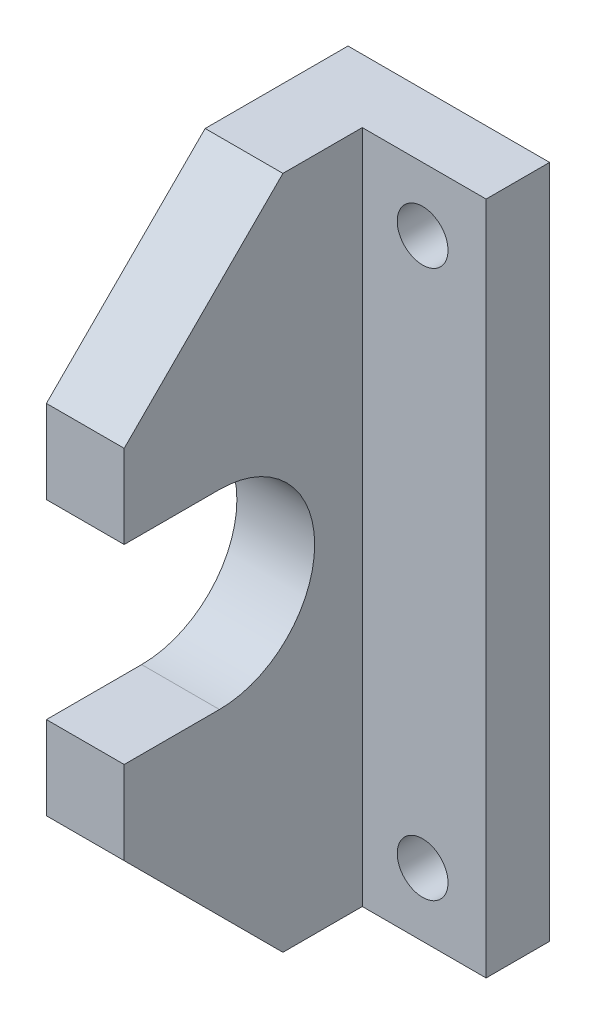
ISO-10303-21;
HEADER;
FILE_DESCRIPTION(('STEP AP214'),'2;1');
FILE_NAME('part.step','',(''),(''),'','','');
FILE_SCHEMA(('AUTOMOTIVE_DESIGN { 1 0 10303 214 1 1 1 1 }'));
ENDSEC;
DATA;
#1=APPLICATION_CONTEXT('core data for automotive mechanical design processes');
#2=APPLICATION_PROTOCOL_DEFINITION('international standard','automotive_design',2000,#1);
#3=PRODUCT_CONTEXT('',#1,'mechanical');
#4=PRODUCT('Part','Part','',(#3));
#5=PRODUCT_RELATED_PRODUCT_CATEGORY('part','',(#4));
#6=PRODUCT_DEFINITION_FORMATION('','',#4);
#7=PRODUCT_DEFINITION_CONTEXT('part definition',#1,'design');
#8=PRODUCT_DEFINITION('design','',#6,#7);
#9=PRODUCT_DEFINITION_SHAPE('','',#8);
#10=(LENGTH_UNIT() NAMED_UNIT(*) SI_UNIT(.MILLI.,.METRE.));
#11=(NAMED_UNIT(*) PLANE_ANGLE_UNIT() SI_UNIT($,.RADIAN.));
#12=(NAMED_UNIT(*) SI_UNIT($,.STERADIAN.) SOLID_ANGLE_UNIT());
#13=UNCERTAINTY_MEASURE_WITH_UNIT(LENGTH_MEASURE(1.E-05),#10,'distance_accuracy_value','');
#14=(GEOMETRIC_REPRESENTATION_CONTEXT(3) GLOBAL_UNCERTAINTY_ASSIGNED_CONTEXT((#13)) GLOBAL_UNIT_ASSIGNED_CONTEXT((#10,
#11,#12)) REPRESENTATION_CONTEXT('',''));
#15=CARTESIAN_POINT('',(0.,0.,0.));
#16=DIRECTION('',(0.,0.,1.));
#17=DIRECTION('',(1.,0.,0.));
#18=AXIS2_PLACEMENT_3D('',#15,#16,#17);
#19=CARTESIAN_POINT('',(0.,0.,19.));
#20=DIRECTION('',(0.,0.,1.));
#21=DIRECTION('',(1.,0.,0.));
#22=AXIS2_PLACEMENT_3D('',#19,#20,#21);
#23=PLANE('',#22);
#24=DIRECTION('',(0.,-1.,0.));
#25=VECTOR('',#24,1.);
#26=CARTESIAN_POINT('',(25.9154898415816,42.4999999977286,19.));
#27=LINE('',#26,#25);
#28=CARTESIAN_POINT('',(25.9154898415816,15.2500004309608,19.));
#29=VERTEX_POINT('',#28);
#30=CARTESIAN_POINT('',(25.9154898415816,9.99999999772865,19.));
#31=VERTEX_POINT('',#30);
#32=EDGE_CURVE('E171',#29,#31,#27,.T.);
#33=ORIENTED_EDGE('',*,*,#32,.T.);
#34=DIRECTION('',(1.,0.,0.));
#35=VECTOR('',#34,1.);
#36=CARTESIAN_POINT('',(30.8154898415816,9.99999999772864,19.));
#37=LINE('',#36,#35);
#38=CARTESIAN_POINT('',(30.8154898415816,9.99999999772866,19.));
#39=VERTEX_POINT('',#38);
#40=EDGE_CURVE('E46',#31,#39,#37,.T.);
#41=ORIENTED_EDGE('',*,*,#40,.T.);
#42=DIRECTION('',(0.,1.,0.));
#43=VECTOR('',#42,1.);
#44=CARTESIAN_POINT('',(30.8154898415816,42.4999999977286,19.));
#45=LINE('',#44,#43);
#46=CARTESIAN_POINT('',(30.8154898415816,15.2500004309608,19.));
#47=VERTEX_POINT('',#46);
#48=EDGE_CURVE('E172',#39,#47,#45,.T.);
#49=ORIENTED_EDGE('',*,*,#48,.T.);
#50=DIRECTION('',(1.,0.,0.));
#51=VECTOR('',#50,1.);
#52=CARTESIAN_POINT('',(25.9154898415816,15.2500004309608,19.));
#53=LINE('',#52,#51);
#54=EDGE_CURVE('E163',#29,#47,#53,.T.);
#55=ORIENTED_EDGE('',*,*,#54,.F.);
#56=EDGE_LOOP('',(#33,#41,#49,#55));
#57=FACE_BOUND('',#56,.T.);
#58=ADVANCED_FACE('F38',(#57),#23,.T.);
#59=CARTESIAN_POINT('',(0.,0.,4.));
#60=DIRECTION('',(0.,0.,-1.));
#61=DIRECTION('',(-1.,0.,0.));
#62=AXIS2_PLACEMENT_3D('',#59,#60,#61);
#63=PLANE('',#62);
#64=CARTESIAN_POINT('',(34.6154898415816,38.4999999977286,4.));
#65=DIRECTION('',(0.,0.,1.));
#66=DIRECTION('',(1.,0.,0.));
#67=AXIS2_PLACEMENT_3D('',#64,#65,#66);
#68=CIRCLE('',#67,1.6);
#69=CARTESIAN_POINT('',(36.2154898415816,38.4999999977286,4.));
#70=VERTEX_POINT('',#69);
#71=EDGE_CURVE('E177',#70,#70,#68,.T.);
#72=ORIENTED_EDGE('',*,*,#71,.F.);
#73=EDGE_LOOP('',(#72));
#74=FACE_BOUND('',#73,.T.);
#75=CARTESIAN_POINT('',(34.6154898415816,3.99999999772863,4.));
#76=DIRECTION('',(0.,0.,1.));
#77=DIRECTION('',(1.,0.,0.));
#78=AXIS2_PLACEMENT_3D('',#75,#76,#77);
#79=CIRCLE('',#78,1.6);
#80=CARTESIAN_POINT('',(36.2154898415816,3.99999999772863,4.));
#81=VERTEX_POINT('',#80);
#82=EDGE_CURVE('E243',#81,#81,#79,.T.);
#83=ORIENTED_EDGE('',*,*,#82,.F.);
#84=EDGE_LOOP('',(#83));
#85=FACE_BOUND('',#84,.T.);
#86=DIRECTION('',(0.,1.,0.));
#87=VECTOR('',#86,1.);
#88=CARTESIAN_POINT('',(30.8154898415816,42.4999999977286,4.));
#89=LINE('',#88,#87);
#90=CARTESIAN_POINT('',(30.8154898415816,-2.2713671249749E-09,4.));
#91=VERTEX_POINT('',#90);
#92=CARTESIAN_POINT('',(30.8154898415816,42.4999999977286,4.));
#93=VERTEX_POINT('',#92);
#94=EDGE_CURVE('E162',#91,#93,#89,.T.);
#95=ORIENTED_EDGE('',*,*,#94,.F.);
#96=DIRECTION('',(1.,0.,0.));
#97=VECTOR('',#96,1.);
#98=CARTESIAN_POINT('',(38.6154898415816,-2.2713671249749E-09,4.));
#99=LINE('',#98,#97);
#100=CARTESIAN_POINT('',(38.6154898415816,-2.2713671249749E-09,4.));
#101=VERTEX_POINT('',#100);
#102=EDGE_CURVE('E183',#91,#101,#99,.T.);
#103=ORIENTED_EDGE('',*,*,#102,.T.);
#104=DIRECTION('',(0.,1.,0.));
#105=VECTOR('',#104,1.);
#106=CARTESIAN_POINT('',(38.6154898415816,42.4999999977286,4.));
#107=LINE('',#106,#105);
#108=CARTESIAN_POINT('',(38.6154898415816,42.4999999977286,4.));
#109=VERTEX_POINT('',#108);
#110=EDGE_CURVE('E234',#101,#109,#107,.T.);
#111=ORIENTED_EDGE('',*,*,#110,.T.);
#112=DIRECTION('',(-1.,0.,0.));
#113=VECTOR('',#112,1.);
#114=CARTESIAN_POINT('',(38.6154898415816,42.4999999977286,4.));
#115=LINE('',#114,#113);
#116=EDGE_CURVE('E231',#109,#93,#115,.T.);
#117=ORIENTED_EDGE('',*,*,#116,.T.);
#118=EDGE_LOOP('',(#95,#103,#111,#117));
#119=FACE_BOUND('',#118,.T.);
#120=ADVANCED_FACE('F268',(#74,#85,#119),#63,.F.);
#121=CARTESIAN_POINT('',(0.,0.,0.));
#122=DIRECTION('',(0.,0.,-1.));
#123=DIRECTION('',(-1.,0.,0.));
#124=AXIS2_PLACEMENT_3D('',#121,#122,#123);
#125=PLANE('',#124);
#126=CARTESIAN_POINT('',(34.6154898415816,3.99999999772863,0.));
#127=DIRECTION('',(0.,0.,1.));
#128=DIRECTION('',(1.,0.,0.));
#129=AXIS2_PLACEMENT_3D('',#126,#127,#128);
#130=CIRCLE('',#129,1.6);
#131=CARTESIAN_POINT('',(36.2154898415816,3.99999999772863,0.));
#132=VERTEX_POINT('',#131);
#133=EDGE_CURVE('E419',#132,#132,#130,.T.);
#134=ORIENTED_EDGE('',*,*,#133,.T.);
#135=EDGE_LOOP('',(#134));
#136=FACE_BOUND('',#135,.T.);
#137=DIRECTION('',(0.,1.,0.));
#138=VECTOR('',#137,1.);
#139=CARTESIAN_POINT('',(38.6154898415816,42.4999999977286,0.));
#140=LINE('',#139,#138);
#141=CARTESIAN_POINT('',(38.6154898415816,-2.2713671249749E-09,0.));
#142=VERTEX_POINT('',#141);
#143=CARTESIAN_POINT('',(38.6154898415816,42.4999999977286,0.));
#144=VERTEX_POINT('',#143);
#145=EDGE_CURVE('E240',#142,#144,#140,.T.);
#146=ORIENTED_EDGE('',*,*,#145,.F.);
#147=DIRECTION('',(1.,0.,0.));
#148=VECTOR('',#147,1.);
#149=CARTESIAN_POINT('',(38.6154898415816,-2.2713671249749E-09,0.));
#150=LINE('',#149,#148);
#151=CARTESIAN_POINT('',(25.9154898415816,-2.2713671249749E-09,0.));
#152=VERTEX_POINT('',#151);
#153=EDGE_CURVE('E247',#152,#142,#150,.T.);
#154=ORIENTED_EDGE('',*,*,#153,.F.);
#155=DIRECTION('',(0.,-1.,0.));
#156=VECTOR('',#155,1.);
#157=CARTESIAN_POINT('',(25.9154898415816,42.4999999977286,0.));
#158=LINE('',#157,#156);
#159=CARTESIAN_POINT('',(25.9154898415816,42.4999999977286,0.));
#160=VERTEX_POINT('',#159);
#161=EDGE_CURVE('E245',#160,#152,#158,.T.);
#162=ORIENTED_EDGE('',*,*,#161,.F.);
#163=DIRECTION('',(-1.,0.,0.));
#164=VECTOR('',#163,1.);
#165=CARTESIAN_POINT('',(38.6154898415816,42.4999999977286,0.));
#166=LINE('',#165,#164);
#167=EDGE_CURVE('E242',#144,#160,#166,.T.);
#168=ORIENTED_EDGE('',*,*,#167,.F.);
#169=EDGE_LOOP('',(#146,#154,#162,#168));
#170=FACE_BOUND('',#169,.T.);
#171=CARTESIAN_POINT('',(34.6154898415816,38.4999999977286,0.));
#172=DIRECTION('',(0.,0.,1.));
#173=DIRECTION('',(1.,0.,0.));
#174=AXIS2_PLACEMENT_3D('',#171,#172,#173);
#175=CIRCLE('',#174,1.6);
#176=CARTESIAN_POINT('',(36.2154898415816,38.4999999977286,0.));
#177=VERTEX_POINT('',#176);
#178=EDGE_CURVE('E199',#177,#177,#175,.T.);
#179=ORIENTED_EDGE('',*,*,#178,.T.);
#180=EDGE_LOOP('',(#179));
#181=FACE_BOUND('',#180,.T.);
#182=ADVANCED_FACE('F259',(#136,#170,#181),#125,.T.);
#183=CARTESIAN_POINT('',(38.6154898415816,42.4999999977286,4.));
#184=DIRECTION('',(-1.,0.,0.));
#185=DIRECTION('',(0.,-1.,0.));
#186=AXIS2_PLACEMENT_3D('',#183,#184,#185);
#187=PLANE('',#186);
#188=ORIENTED_EDGE('',*,*,#145,.T.);
#189=DIRECTION('',(0.,0.,-1.));
#190=VECTOR('',#189,1.);
#191=CARTESIAN_POINT('',(38.6154898415816,42.4999999977286,4.));
#192=LINE('',#191,#190);
#193=EDGE_CURVE('E218',#109,#144,#192,.T.);
#194=ORIENTED_EDGE('',*,*,#193,.F.);
#195=ORIENTED_EDGE('',*,*,#110,.F.);
#196=DIRECTION('',(0.,0.,-1.));
#197=VECTOR('',#196,1.);
#198=CARTESIAN_POINT('',(38.6154898415816,-2.2713671249749E-09,4.));
#199=LINE('',#198,#197);
#200=EDGE_CURVE('E249',#101,#142,#199,.T.);
#201=ORIENTED_EDGE('',*,*,#200,.T.);
#202=EDGE_LOOP('',(#188,#194,#195,#201));
#203=FACE_BOUND('',#202,.T.);
#204=ADVANCED_FACE('F262',(#203),#187,.F.);
#205=CARTESIAN_POINT('',(38.6154898415816,42.4999999977286,4.));
#206=DIRECTION('',(0.,-1.,0.));
#207=DIRECTION('',(0.,0.,-1.));
#208=AXIS2_PLACEMENT_3D('',#205,#206,#207);
#209=PLANE('',#208);
#210=DIRECTION('',(0.,0.,-1.));
#211=VECTOR('',#210,1.);
#212=CARTESIAN_POINT('',(25.9154898415816,42.4999999977286,4.));
#213=LINE('',#212,#211);
#214=CARTESIAN_POINT('',(25.9154898415816,42.4999999977286,8.99999999999996));
#215=VERTEX_POINT('',#214);
#216=EDGE_CURVE('E223',#215,#160,#213,.T.);
#217=ORIENTED_EDGE('',*,*,#216,.F.);
#218=DIRECTION('',(1.,0.,0.));
#219=VECTOR('',#218,1.);
#220=CARTESIAN_POINT('',(30.8154898415816,42.4999999977286,8.99999999999996));
#221=LINE('',#220,#219);
#222=CARTESIAN_POINT('',(30.8154898415816,42.4999999977286,8.99999999999996));
#223=VERTEX_POINT('',#222);
#224=EDGE_CURVE('E196',#215,#223,#221,.T.);
#225=ORIENTED_EDGE('',*,*,#224,.T.);
#226=DIRECTION('',(0.,0.,-1.));
#227=VECTOR('',#226,1.);
#228=CARTESIAN_POINT('',(30.8154898415816,42.4999999977286,19.));
#229=LINE('',#228,#227);
#230=EDGE_CURVE('E174',#223,#93,#229,.T.);
#231=ORIENTED_EDGE('',*,*,#230,.T.);
#232=ORIENTED_EDGE('',*,*,#116,.F.);
#233=ORIENTED_EDGE('',*,*,#193,.T.);
#234=ORIENTED_EDGE('',*,*,#167,.T.);
#235=EDGE_LOOP('',(#217,#225,#231,#232,#233,#234));
#236=FACE_BOUND('',#235,.T.);
#237=ADVANCED_FACE('F274',(#236),#209,.F.);
#238=CARTESIAN_POINT('',(25.9154898415816,42.4999999977286,4.));
#239=DIRECTION('',(1.,0.,0.));
#240=DIRECTION('',(0.,1.,0.));
#241=AXIS2_PLACEMENT_3D('',#238,#239,#240);
#242=PLANE('',#241);
#243=CARTESIAN_POINT('',(25.9154898415816,32.4999999977286,19.));
#244=VERTEX_POINT('',#243);
#245=CARTESIAN_POINT('',(25.9154898415816,27.2500004309608,19.));
#246=VERTEX_POINT('',#245);
#247=EDGE_CURVE('E168',#244,#246,#27,.T.);
#248=ORIENTED_EDGE('',*,*,#247,.F.);
#249=DIRECTION('',(0.,0.707106781186546,-0.707106781186549));
#250=VECTOR('',#249,1.);
#251=CARTESIAN_POINT('',(25.9154898415816,32.4999999977286,19.));
#252=LINE('',#251,#250);
#253=EDGE_CURVE('E194',#244,#215,#252,.T.);
#254=ORIENTED_EDGE('',*,*,#253,.T.);
#255=ORIENTED_EDGE('',*,*,#216,.T.);
#256=ORIENTED_EDGE('',*,*,#161,.T.);
#257=DIRECTION('',(0.,0.,-1.));
#258=VECTOR('',#257,1.);
#259=CARTESIAN_POINT('',(25.9154898415816,-2.2713671249749E-09,4.));
#260=LINE('',#259,#258);
#261=CARTESIAN_POINT('',(25.9154898415816,-2.27136885829299E-09,8.99999999999995));
#262=VERTEX_POINT('',#261);
#263=EDGE_CURVE('E215',#262,#152,#260,.T.);
#264=ORIENTED_EDGE('',*,*,#263,.F.);
#265=DIRECTION('',(0.,0.707106781186546,0.707106781186549));
#266=VECTOR('',#265,1.);
#267=CARTESIAN_POINT('',(25.9154898415816,9.99999999772864,19.));
#268=LINE('',#267,#266);
#269=EDGE_CURVE('E212',#262,#31,#268,.T.);
#270=ORIENTED_EDGE('',*,*,#269,.T.);
#271=ORIENTED_EDGE('',*,*,#32,.F.);
#272=DIRECTION('',(0.,0.,-1.));
#273=VECTOR('',#272,1.);
#274=CARTESIAN_POINT('',(25.9154898415816,15.2500004309608,19.));
#275=LINE('',#274,#273);
#276=CARTESIAN_POINT('',(25.9154898415816,15.2500004309608,13.));
#277=VERTEX_POINT('',#276);
#278=EDGE_CURVE('E138',#29,#277,#275,.T.);
#279=ORIENTED_EDGE('',*,*,#278,.T.);
#280=CARTESIAN_POINT('',(25.9154898415816,21.2500004309608,13.));
#281=DIRECTION('',(1.,0.,0.));
#282=DIRECTION('',(0.,1.,0.));
#283=AXIS2_PLACEMENT_3D('',#280,#281,#282);
#284=CIRCLE('',#283,6.);
#285=CARTESIAN_POINT('',(25.9154898415816,27.2500004309608,13.));
#286=VERTEX_POINT('',#285);
#287=EDGE_CURVE('E131',#277,#286,#284,.T.);
#288=ORIENTED_EDGE('',*,*,#287,.T.);
#289=DIRECTION('',(0.,0.,1.));
#290=VECTOR('',#289,1.);
#291=CARTESIAN_POINT('',(25.9154898415816,27.2500004309608,13.));
#292=LINE('',#291,#290);
#293=EDGE_CURVE('E142',#286,#246,#292,.T.);
#294=ORIENTED_EDGE('',*,*,#293,.T.);
#295=EDGE_LOOP('',(#248,#254,#255,#256,#264,#270,#271,#279,#288,#294));
#296=FACE_BOUND('',#295,.T.);
#297=ADVANCED_FACE('F148',(#296),#242,.F.);
#298=CARTESIAN_POINT('',(38.6154898415816,-2.2713671249749E-09,4.));
#299=DIRECTION('',(0.,1.,0.));
#300=DIRECTION('',(0.,0.,1.));
#301=AXIS2_PLACEMENT_3D('',#298,#299,#300);
#302=PLANE('',#301);
#303=DIRECTION('',(0.,0.,-1.));
#304=VECTOR('',#303,1.);
#305=CARTESIAN_POINT('',(30.8154898415816,-2.2713671249749E-09,19.));
#306=LINE('',#305,#304);
#307=CARTESIAN_POINT('',(30.8154898415816,-2.2713671249749E-09,8.99999999999996));
#308=VERTEX_POINT('',#307);
#309=EDGE_CURVE('E193',#308,#91,#306,.T.);
#310=ORIENTED_EDGE('',*,*,#309,.F.);
#311=DIRECTION('',(-1.,0.,0.));
#312=VECTOR('',#311,1.);
#313=CARTESIAN_POINT('',(25.9154898415816,-2.2713671249749E-09,8.99999999999996));
#314=LINE('',#313,#312);
#315=EDGE_CURVE('E11',#308,#262,#314,.T.);
#316=ORIENTED_EDGE('',*,*,#315,.T.);
#317=ORIENTED_EDGE('',*,*,#263,.T.);
#318=ORIENTED_EDGE('',*,*,#153,.T.);
#319=ORIENTED_EDGE('',*,*,#200,.F.);
#320=ORIENTED_EDGE('',*,*,#102,.F.);
#321=EDGE_LOOP('',(#310,#316,#317,#318,#319,#320));
#322=FACE_BOUND('',#321,.T.);
#323=ADVANCED_FACE('F252',(#322),#302,.F.);
#324=CARTESIAN_POINT('',(34.6154898415816,3.99999999772863,4.));
#325=DIRECTION('',(0.,0.,-1.));
#326=DIRECTION('',(-1.,0.,0.));
#327=AXIS2_PLACEMENT_3D('',#324,#325,#326);
#328=CYLINDRICAL_SURFACE('',#327,1.6);
#329=ORIENTED_EDGE('',*,*,#82,.T.);
#330=EDGE_LOOP('',(#329));
#331=FACE_BOUND('',#330,.T.);
#332=ORIENTED_EDGE('',*,*,#133,.F.);
#333=EDGE_LOOP('',(#332));
#334=FACE_BOUND('',#333,.T.);
#335=ADVANCED_FACE('F302',(#331,#334),#328,.F.);
#336=CARTESIAN_POINT('',(34.6154898415816,38.4999999977286,4.));
#337=DIRECTION('',(0.,0.,-1.));
#338=DIRECTION('',(-1.,0.,0.));
#339=AXIS2_PLACEMENT_3D('',#336,#337,#338);
#340=CYLINDRICAL_SURFACE('',#339,1.6);
#341=ORIENTED_EDGE('',*,*,#71,.T.);
#342=EDGE_LOOP('',(#341));
#343=FACE_BOUND('',#342,.T.);
#344=ORIENTED_EDGE('',*,*,#178,.F.);
#345=EDGE_LOOP('',(#344));
#346=FACE_BOUND('',#345,.T.);
#347=ADVANCED_FACE('F298',(#343,#346),#340,.F.);
#348=CARTESIAN_POINT('',(30.8154898415816,42.4999999977286,19.));
#349=DIRECTION('',(-1.,0.,0.));
#350=DIRECTION('',(0.,-1.,0.));
#351=AXIS2_PLACEMENT_3D('',#348,#349,#350);
#352=PLANE('',#351);
#353=ORIENTED_EDGE('',*,*,#230,.F.);
#354=DIRECTION('',(0.,-0.707106781186546,0.707106781186549));
#355=VECTOR('',#354,1.);
#356=CARTESIAN_POINT('',(30.8154898415816,32.4999999977286,19.));
#357=LINE('',#356,#355);
#358=CARTESIAN_POINT('',(30.8154898415816,32.4999999977286,19.));
#359=VERTEX_POINT('',#358);
#360=EDGE_CURVE('E201',#223,#359,#357,.T.);
#361=ORIENTED_EDGE('',*,*,#360,.T.);
#362=CARTESIAN_POINT('',(30.8154898415816,27.2500004309608,19.));
#363=VERTEX_POINT('',#362);
#364=EDGE_CURVE('E170',#363,#359,#45,.T.);
#365=ORIENTED_EDGE('',*,*,#364,.F.);
#366=DIRECTION('',(0.,0.,1.));
#367=VECTOR('',#366,1.);
#368=CARTESIAN_POINT('',(30.8154898415816,27.2500004309608,13.));
#369=LINE('',#368,#367);
#370=CARTESIAN_POINT('',(30.8154898415816,27.2500004309608,13.));
#371=VERTEX_POINT('',#370);
#372=EDGE_CURVE('E153',#371,#363,#369,.T.);
#373=ORIENTED_EDGE('',*,*,#372,.F.);
#374=CARTESIAN_POINT('',(30.8154898415816,21.2500004309608,13.));
#375=DIRECTION('',(1.,0.,0.));
#376=DIRECTION('',(0.,1.,0.));
#377=AXIS2_PLACEMENT_3D('',#374,#375,#376);
#378=CIRCLE('',#377,6.);
#379=CARTESIAN_POINT('',(30.8154898415816,15.2500004309608,13.));
#380=VERTEX_POINT('',#379);
#381=EDGE_CURVE('E134',#380,#371,#378,.T.);
#382=ORIENTED_EDGE('',*,*,#381,.F.);
#383=DIRECTION('',(0.,0.,-1.));
#384=VECTOR('',#383,1.);
#385=CARTESIAN_POINT('',(30.8154898415816,15.2500004309608,19.));
#386=LINE('',#385,#384);
#387=EDGE_CURVE('E150',#47,#380,#386,.T.);
#388=ORIENTED_EDGE('',*,*,#387,.F.);
#389=ORIENTED_EDGE('',*,*,#48,.F.);
#390=DIRECTION('',(0.,-0.707106781186546,-0.707106781186549));
#391=VECTOR('',#390,1.);
#392=CARTESIAN_POINT('',(30.8154898415816,9.99999999772864,19.));
#393=LINE('',#392,#391);
#394=EDGE_CURVE('E53',#39,#308,#393,.T.);
#395=ORIENTED_EDGE('',*,*,#394,.T.);
#396=ORIENTED_EDGE('',*,*,#309,.T.);
#397=ORIENTED_EDGE('',*,*,#94,.T.);
#398=EDGE_LOOP('',(#353,#361,#365,#373,#382,#388,#389,#395,#396,#397));
#399=FACE_BOUND('',#398,.T.);
#400=ADVANCED_FACE('F208',(#399),#352,.F.);
#401=ORIENTED_EDGE('',*,*,#364,.T.);
#402=DIRECTION('',(-1.,0.,0.));
#403=VECTOR('',#402,1.);
#404=CARTESIAN_POINT('',(25.9154898415816,32.4999999977286,19.));
#405=LINE('',#404,#403);
#406=EDGE_CURVE('E216',#359,#244,#405,.T.);
#407=ORIENTED_EDGE('',*,*,#406,.T.);
#408=ORIENTED_EDGE('',*,*,#247,.T.);
#409=DIRECTION('',(1.,0.,0.));
#410=VECTOR('',#409,1.);
#411=CARTESIAN_POINT('',(25.9154898415816,27.2500004309608,19.));
#412=LINE('',#411,#410);
#413=EDGE_CURVE('E137',#246,#363,#412,.T.);
#414=ORIENTED_EDGE('',*,*,#413,.T.);
#415=EDGE_LOOP('',(#401,#407,#408,#414));
#416=FACE_BOUND('',#415,.T.);
#417=ADVANCED_FACE('F285',(#416),#23,.T.);
#418=CARTESIAN_POINT('',(25.9154898415816,21.2500004309608,13.));
#419=DIRECTION('',(1.,0.,0.));
#420=DIRECTION('',(0.,1.,0.));
#421=AXIS2_PLACEMENT_3D('',#418,#419,#420);
#422=CYLINDRICAL_SURFACE('',#421,6.);
#423=ORIENTED_EDGE('',*,*,#381,.T.);
#424=DIRECTION('',(1.,0.,0.));
#425=VECTOR('',#424,1.);
#426=CARTESIAN_POINT('',(25.9154898415816,27.2500004309608,13.));
#427=LINE('',#426,#425);
#428=EDGE_CURVE('E127',#286,#371,#427,.T.);
#429=ORIENTED_EDGE('',*,*,#428,.F.);
#430=ORIENTED_EDGE('',*,*,#287,.F.);
#431=DIRECTION('',(1.,0.,0.));
#432=VECTOR('',#431,1.);
#433=CARTESIAN_POINT('',(25.9154898415816,15.2500004309608,13.));
#434=LINE('',#433,#432);
#435=EDGE_CURVE('E160',#277,#380,#434,.T.);
#436=ORIENTED_EDGE('',*,*,#435,.T.);
#437=EDGE_LOOP('',(#423,#429,#430,#436));
#438=FACE_BOUND('',#437,.T.);
#439=ADVANCED_FACE('F129',(#438),#422,.F.);
#440=CARTESIAN_POINT('',(25.9154898415816,15.2500004309608,19.));
#441=DIRECTION('',(0.,-1.,0.));
#442=DIRECTION('',(0.,0.,-1.));
#443=AXIS2_PLACEMENT_3D('',#440,#441,#442);
#444=PLANE('',#443);
#445=ORIENTED_EDGE('',*,*,#387,.T.);
#446=ORIENTED_EDGE('',*,*,#435,.F.);
#447=ORIENTED_EDGE('',*,*,#278,.F.);
#448=ORIENTED_EDGE('',*,*,#54,.T.);
#449=EDGE_LOOP('',(#445,#446,#447,#448));
#450=FACE_BOUND('',#449,.T.);
#451=ADVANCED_FACE('F210',(#450),#444,.F.);
#452=CARTESIAN_POINT('',(25.9154898415816,27.2500004309608,13.));
#453=DIRECTION('',(0.,1.,0.));
#454=DIRECTION('',(-1.,0.,0.));
#455=AXIS2_PLACEMENT_3D('',#452,#453,#454);
#456=PLANE('',#455);
#457=ORIENTED_EDGE('',*,*,#372,.T.);
#458=ORIENTED_EDGE('',*,*,#413,.F.);
#459=ORIENTED_EDGE('',*,*,#293,.F.);
#460=ORIENTED_EDGE('',*,*,#428,.T.);
#461=EDGE_LOOP('',(#457,#458,#459,#460));
#462=FACE_BOUND('',#461,.T.);
#463=ADVANCED_FACE('F143',(#462),#456,.F.);
#464=CARTESIAN_POINT('',(0.,32.4999999977286,19.));
#465=DIRECTION('',(0.,0.707106781186549,0.707106781186546));
#466=DIRECTION('',(1.,0.,0.));
#467=AXIS2_PLACEMENT_3D('',#464,#465,#466);
#468=PLANE('',#467);
#469=ORIENTED_EDGE('',*,*,#360,.F.);
#470=ORIENTED_EDGE('',*,*,#224,.F.);
#471=ORIENTED_EDGE('',*,*,#253,.F.);
#472=ORIENTED_EDGE('',*,*,#406,.F.);
#473=EDGE_LOOP('',(#469,#470,#471,#472));
#474=FACE_BOUND('',#473,.T.);
#475=ADVANCED_FACE('F273',(#474),#468,.T.);
#476=CARTESIAN_POINT('',(0.,9.99999999772864,19.));
#477=DIRECTION('',(0.,-0.707106781186549,0.707106781186546));
#478=DIRECTION('',(-1.,0.,0.));
#479=AXIS2_PLACEMENT_3D('',#476,#477,#478);
#480=PLANE('',#479);
#481=ORIENTED_EDGE('',*,*,#269,.F.);
#482=ORIENTED_EDGE('',*,*,#315,.F.);
#483=ORIENTED_EDGE('',*,*,#394,.F.);
#484=ORIENTED_EDGE('',*,*,#40,.F.);
#485=EDGE_LOOP('',(#481,#482,#483,#484));
#486=FACE_BOUND('',#485,.T.);
#487=ADVANCED_FACE('F40',(#486),#480,.T.);
#488=CLOSED_SHELL('',(#58,#120,#182,#204,#237,#297,#323,#335,#347,#400,#417,#439,#451,#463,#475,#487));
#489=MANIFOLD_SOLID_BREP('B2',#488);
#490=ADVANCED_BREP_SHAPE_REPRESENTATION('',(#18,#489),#14);
#491=SHAPE_DEFINITION_REPRESENTATION(#9,#490);
ENDSEC;
END-ISO-10303-21;
